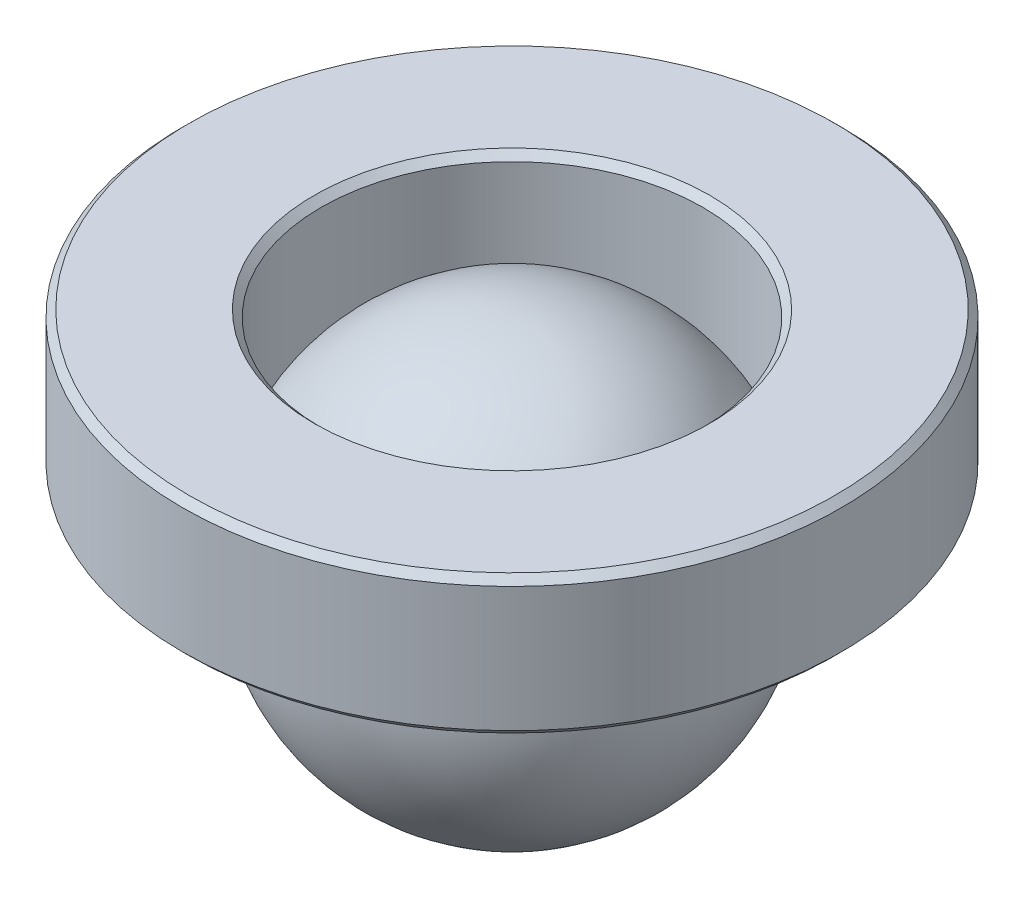
ISO-10303-21;
HEADER;
FILE_DESCRIPTION(('STEP AP214'),'2;1');
FILE_NAME('part.step','',(''),(''),'','','');
FILE_SCHEMA(('AUTOMOTIVE_DESIGN { 1 0 10303 214 1 1 1 1 }'));
ENDSEC;
DATA;
#1=APPLICATION_CONTEXT('core data for automotive mechanical design processes');
#2=APPLICATION_PROTOCOL_DEFINITION('international standard','automotive_design',2000,#1);
#3=PRODUCT_CONTEXT('',#1,'mechanical');
#4=PRODUCT('Part','Part','',(#3));
#5=PRODUCT_RELATED_PRODUCT_CATEGORY('part','',(#4));
#6=PRODUCT_DEFINITION_FORMATION('','',#4);
#7=PRODUCT_DEFINITION_CONTEXT('part definition',#1,'design');
#8=PRODUCT_DEFINITION('design','',#6,#7);
#9=PRODUCT_DEFINITION_SHAPE('','',#8);
#10=(LENGTH_UNIT() NAMED_UNIT(*) SI_UNIT(.MILLI.,.METRE.));
#11=(NAMED_UNIT(*) PLANE_ANGLE_UNIT() SI_UNIT($,.RADIAN.));
#12=(NAMED_UNIT(*) SI_UNIT($,.STERADIAN.) SOLID_ANGLE_UNIT());
#13=UNCERTAINTY_MEASURE_WITH_UNIT(LENGTH_MEASURE(1.E-05),#10,'distance_accuracy_value','');
#14=(GEOMETRIC_REPRESENTATION_CONTEXT(3) GLOBAL_UNCERTAINTY_ASSIGNED_CONTEXT((#13)) GLOBAL_UNIT_ASSIGNED_CONTEXT((#10,
#11,#12)) REPRESENTATION_CONTEXT('',''));
#15=CARTESIAN_POINT('',(0.,0.,0.));
#16=DIRECTION('',(0.,0.,1.));
#17=DIRECTION('',(1.,0.,0.));
#18=AXIS2_PLACEMENT_3D('',#15,#16,#17);
#19=CARTESIAN_POINT('',(0.,0.,0.));
#20=DIRECTION('',(0.,1.,0.));
#21=DIRECTION('',(1.,0.,0.));
#22=AXIS2_PLACEMENT_3D('',#19,#20,#21);
#23=SPHERICAL_SURFACE('',#22,3.);
#24=CARTESIAN_POINT('',(0.,3.,0.));
#25=VERTEX_POINT('',#24);
#26=VERTEX_LOOP('',#25);
#27=FACE_BOUND('',#26,.T.);
#28=ADVANCED_FACE('F36',(#27),#23,.T.);
#29=CLOSED_SHELL('',(#28));
#30=MANIFOLD_SOLID_BREP('B2',#29);
#31=CARTESIAN_POINT('',(-4.65,1.09895788082818,0.));
#32=DIRECTION('',(0.,-1.,0.));
#33=DIRECTION('',(0.,0.,-1.));
#34=AXIS2_PLACEMENT_3D('',#31,#32,#33);
#35=PLANE('',#34);
#36=CARTESIAN_POINT('',(0.,1.09895788082818,0.));
#37=DIRECTION('',(0.,1.,0.));
#38=DIRECTION('',(0.,0.,1.));
#39=AXIS2_PLACEMENT_3D('',#36,#37,#38);
#40=CIRCLE('',#39,2.85);
#41=CARTESIAN_POINT('',(0.,1.09895788082818,2.85));
#42=VERTEX_POINT('',#41);
#43=EDGE_CURVE('E76',#42,#42,#40,.T.);
#44=ORIENTED_EDGE('',*,*,#43,.T.);
#45=EDGE_LOOP('',(#44));
#46=FACE_BOUND('',#45,.T.);
#47=CARTESIAN_POINT('',(0.,1.09895788082818,0.));
#48=DIRECTION('',(0.,1.,0.));
#49=DIRECTION('',(0.,0.,1.));
#50=AXIS2_PLACEMENT_3D('',#47,#48,#49);
#51=CIRCLE('',#50,4.65);
#52=CARTESIAN_POINT('',(0.,1.09895788082818,4.65));
#53=VERTEX_POINT('',#52);
#54=EDGE_CURVE('E35',#53,#53,#51,.T.);
#55=ORIENTED_EDGE('',*,*,#54,.F.);
#56=EDGE_LOOP('',(#55));
#57=FACE_BOUND('',#56,.T.);
#58=ADVANCED_FACE('F48',(#46,#57),#35,.T.);
#59=CARTESIAN_POINT('',(0.,1.19895788082818,0.));
#60=DIRECTION('',(0.,1.,0.));
#61=DIRECTION('',(0.,0.,1.));
#62=AXIS2_PLACEMENT_3D('',#59,#60,#61);
#63=CONICAL_SURFACE('',#62,4.75,0.785398163397449);
#64=ORIENTED_EDGE('',*,*,#54,.T.);
#65=EDGE_LOOP('',(#64));
#66=FACE_BOUND('',#65,.T.);
#67=CARTESIAN_POINT('',(0.,1.19895788082818,0.));
#68=DIRECTION('',(0.,1.,0.));
#69=DIRECTION('',(0.,0.,1.));
#70=AXIS2_PLACEMENT_3D('',#67,#68,#69);
#71=CIRCLE('',#70,4.75);
#72=CARTESIAN_POINT('',(0.,1.19895788082818,4.75));
#73=VERTEX_POINT('',#72);
#74=EDGE_CURVE('E54',#73,#73,#71,.T.);
#75=ORIENTED_EDGE('',*,*,#74,.F.);
#76=EDGE_LOOP('',(#75));
#77=FACE_BOUND('',#76,.T.);
#78=ADVANCED_FACE('F94',(#66,#77),#63,.T.);
#79=CARTESIAN_POINT('',(0.,3.,0.));
#80=DIRECTION('',(0.,1.,0.));
#81=DIRECTION('',(0.,0.,1.));
#82=AXIS2_PLACEMENT_3D('',#79,#80,#81);
#83=CYLINDRICAL_SURFACE('',#82,4.75);
#84=ORIENTED_EDGE('',*,*,#74,.T.);
#85=EDGE_LOOP('',(#84));
#86=FACE_BOUND('',#85,.T.);
#87=CARTESIAN_POINT('',(0.,2.99895788082818,0.));
#88=DIRECTION('',(0.,1.,0.));
#89=DIRECTION('',(0.,0.,1.));
#90=AXIS2_PLACEMENT_3D('',#87,#88,#89);
#91=CIRCLE('',#90,4.75);
#92=CARTESIAN_POINT('',(0.,2.99895788082818,4.75));
#93=VERTEX_POINT('',#92);
#94=EDGE_CURVE('E58',#93,#93,#91,.T.);
#95=ORIENTED_EDGE('',*,*,#94,.F.);
#96=EDGE_LOOP('',(#95));
#97=FACE_BOUND('',#96,.T.);
#98=ADVANCED_FACE('F98',(#86,#97),#83,.T.);
#99=CARTESIAN_POINT('',(0.,3.09895788082818,0.));
#100=DIRECTION('',(0.,-1.,0.));
#101=DIRECTION('',(0.,0.,-1.));
#102=AXIS2_PLACEMENT_3D('',#99,#100,#101);
#103=CONICAL_SURFACE('',#102,4.65,0.785398163397446);
#104=ORIENTED_EDGE('',*,*,#94,.T.);
#105=EDGE_LOOP('',(#104));
#106=FACE_BOUND('',#105,.T.);
#107=CARTESIAN_POINT('',(0.,3.09895788082818,0.));
#108=DIRECTION('',(0.,1.,0.));
#109=DIRECTION('',(0.,0.,1.));
#110=AXIS2_PLACEMENT_3D('',#107,#108,#109);
#111=CIRCLE('',#110,4.65);
#112=CARTESIAN_POINT('',(0.,3.09895788082818,4.65));
#113=VERTEX_POINT('',#112);
#114=EDGE_CURVE('E62',#113,#113,#111,.T.);
#115=ORIENTED_EDGE('',*,*,#114,.F.);
#116=EDGE_LOOP('',(#115));
#117=FACE_BOUND('',#116,.T.);
#118=ADVANCED_FACE('F102',(#106,#117),#103,.T.);
#119=CARTESIAN_POINT('',(-4.65,3.09895788082818,0.));
#120=DIRECTION('',(0.,1.,0.));
#121=DIRECTION('',(0.,0.,1.));
#122=AXIS2_PLACEMENT_3D('',#119,#120,#121);
#123=PLANE('',#122);
#124=ORIENTED_EDGE('',*,*,#114,.T.);
#125=EDGE_LOOP('',(#124));
#126=FACE_BOUND('',#125,.T.);
#127=CARTESIAN_POINT('',(0.,3.09895788082818,0.));
#128=DIRECTION('',(0.,1.,0.));
#129=DIRECTION('',(0.,0.,1.));
#130=AXIS2_PLACEMENT_3D('',#127,#128,#129);
#131=CIRCLE('',#130,2.85);
#132=CARTESIAN_POINT('',(0.,3.09895788082818,2.85));
#133=VERTEX_POINT('',#132);
#134=EDGE_CURVE('E67',#133,#133,#131,.T.);
#135=ORIENTED_EDGE('',*,*,#134,.F.);
#136=EDGE_LOOP('',(#135));
#137=FACE_BOUND('',#136,.T.);
#138=ADVANCED_FACE('F108',(#126,#137),#123,.T.);
#139=CARTESIAN_POINT('',(0.,2.99895788082818,0.));
#140=DIRECTION('',(0.,1.,0.));
#141=DIRECTION('',(0.,0.,1.));
#142=AXIS2_PLACEMENT_3D('',#139,#140,#141);
#143=CONICAL_SURFACE('',#142,2.75,0.785398163397453);
#144=ORIENTED_EDGE('',*,*,#134,.T.);
#145=EDGE_LOOP('',(#144));
#146=FACE_BOUND('',#145,.T.);
#147=CARTESIAN_POINT('',(0.,2.99895788082818,0.));
#148=DIRECTION('',(0.,1.,0.));
#149=DIRECTION('',(0.,0.,1.));
#150=AXIS2_PLACEMENT_3D('',#147,#148,#149);
#151=CIRCLE('',#150,2.75);
#152=CARTESIAN_POINT('',(0.,2.99895788082818,2.75));
#153=VERTEX_POINT('',#152);
#154=EDGE_CURVE('E70',#153,#153,#151,.T.);
#155=ORIENTED_EDGE('',*,*,#154,.F.);
#156=EDGE_LOOP('',(#155));
#157=FACE_BOUND('',#156,.T.);
#158=ADVANCED_FACE('F90',(#146,#157),#143,.F.);
#159=CARTESIAN_POINT('',(0.,3.,0.));
#160=DIRECTION('',(0.,1.,0.));
#161=DIRECTION('',(0.,0.,1.));
#162=AXIS2_PLACEMENT_3D('',#159,#160,#161);
#163=CYLINDRICAL_SURFACE('',#162,2.75);
#164=ORIENTED_EDGE('',*,*,#154,.T.);
#165=EDGE_LOOP('',(#164));
#166=FACE_BOUND('',#165,.T.);
#167=CARTESIAN_POINT('',(0.,1.19895788082818,0.));
#168=DIRECTION('',(0.,1.,0.));
#169=DIRECTION('',(0.,0.,1.));
#170=AXIS2_PLACEMENT_3D('',#167,#168,#169);
#171=CIRCLE('',#170,2.75);
#172=CARTESIAN_POINT('',(0.,1.19895788082818,2.75));
#173=VERTEX_POINT('',#172);
#174=EDGE_CURVE('E73',#173,#173,#171,.T.);
#175=ORIENTED_EDGE('',*,*,#174,.F.);
#176=EDGE_LOOP('',(#175));
#177=FACE_BOUND('',#176,.T.);
#178=ADVANCED_FACE('F84',(#166,#177),#163,.F.);
#179=CARTESIAN_POINT('',(0.,1.09895788082818,0.));
#180=DIRECTION('',(0.,-1.,0.));
#181=DIRECTION('',(0.,0.,-1.));
#182=AXIS2_PLACEMENT_3D('',#179,#180,#181);
#183=CONICAL_SURFACE('',#182,2.85,0.785398163397444);
#184=ORIENTED_EDGE('',*,*,#174,.T.);
#185=EDGE_LOOP('',(#184));
#186=FACE_BOUND('',#185,.T.);
#187=ORIENTED_EDGE('',*,*,#43,.F.);
#188=EDGE_LOOP('',(#187));
#189=FACE_BOUND('',#188,.T.);
#190=ADVANCED_FACE('F82',(#186,#189),#183,.F.);
#191=CLOSED_SHELL('',(#58,#78,#98,#118,#138,#158,#178,#190));
#192=MANIFOLD_SOLID_BREP('B6',#191);
#193=ADVANCED_BREP_SHAPE_REPRESENTATION('',(#18,#30,#192),#14);
#194=SHAPE_DEFINITION_REPRESENTATION(#9,#193);
ENDSEC;
END-ISO-10303-21;
